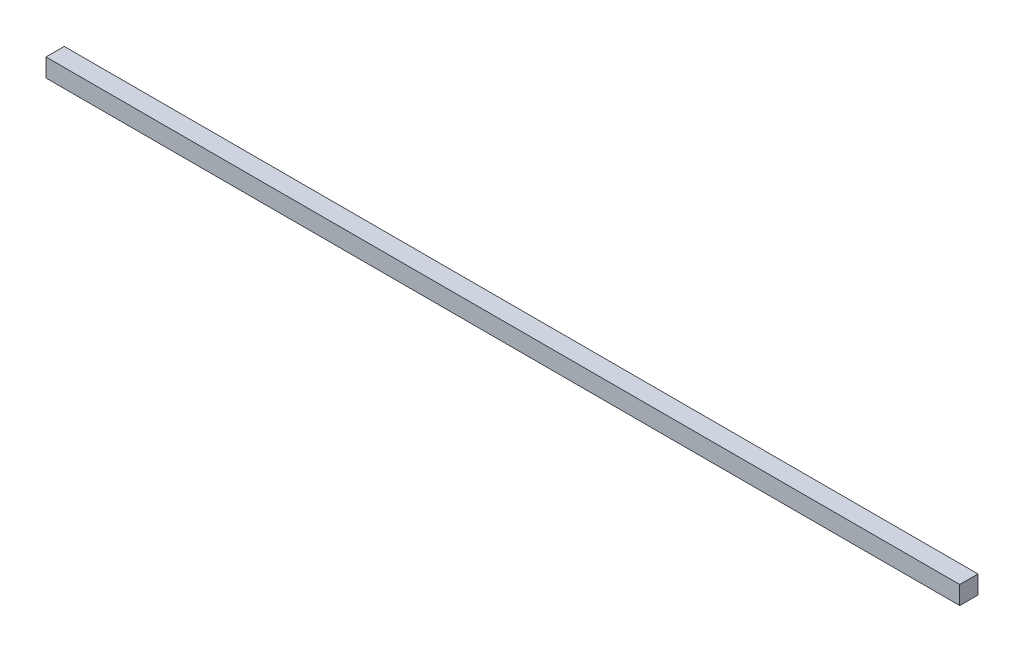
ISO-10303-21;
HEADER;
FILE_DESCRIPTION(('STEP AP214'),'2;1');
FILE_NAME('part.step','',(''),(''),'','','');
FILE_SCHEMA(('AUTOMOTIVE_DESIGN { 1 0 10303 214 1 1 1 1 }'));
ENDSEC;
DATA;
#1=APPLICATION_CONTEXT('core data for automotive mechanical design processes');
#2=APPLICATION_PROTOCOL_DEFINITION('international standard','automotive_design',2000,#1);
#3=PRODUCT_CONTEXT('',#1,'mechanical');
#4=PRODUCT('Part','Part','',(#3));
#5=PRODUCT_RELATED_PRODUCT_CATEGORY('part','',(#4));
#6=PRODUCT_DEFINITION_FORMATION('','',#4);
#7=PRODUCT_DEFINITION_CONTEXT('part definition',#1,'design');
#8=PRODUCT_DEFINITION('design','',#6,#7);
#9=PRODUCT_DEFINITION_SHAPE('','',#8);
#10=(LENGTH_UNIT() NAMED_UNIT(*) SI_UNIT(.MILLI.,.METRE.));
#11=(NAMED_UNIT(*) PLANE_ANGLE_UNIT() SI_UNIT($,.RADIAN.));
#12=(NAMED_UNIT(*) SI_UNIT($,.STERADIAN.) SOLID_ANGLE_UNIT());
#13=UNCERTAINTY_MEASURE_WITH_UNIT(LENGTH_MEASURE(1.E-05),#10,'distance_accuracy_value','');
#14=(GEOMETRIC_REPRESENTATION_CONTEXT(3) GLOBAL_UNCERTAINTY_ASSIGNED_CONTEXT((#13)) GLOBAL_UNIT_ASSIGNED_CONTEXT((#10,
#11,#12)) REPRESENTATION_CONTEXT('',''));
#15=CARTESIAN_POINT('',(0.,0.,0.));
#16=DIRECTION('',(0.,0.,1.));
#17=DIRECTION('',(1.,0.,0.));
#18=AXIS2_PLACEMENT_3D('',#15,#16,#17);
#19=CARTESIAN_POINT('',(100.,-1.,-1.));
#20=DIRECTION('',(0.,0.,1.));
#21=DIRECTION('',(1.,0.,0.));
#22=AXIS2_PLACEMENT_3D('',#19,#20,#21);
#23=PLANE('',#22);
#24=DIRECTION('',(0.,1.,0.));
#25=VECTOR('',#24,1.);
#26=CARTESIAN_POINT('',(0.,-1.,-1.));
#27=LINE('',#26,#25);
#28=CARTESIAN_POINT('',(0.,-1.,-1.));
#29=VERTEX_POINT('',#28);
#30=CARTESIAN_POINT('',(0.,1.,-1.));
#31=VERTEX_POINT('',#30);
#32=EDGE_CURVE('E98',#29,#31,#27,.T.);
#33=ORIENTED_EDGE('',*,*,#32,.T.);
#34=DIRECTION('',(-1.,0.,0.));
#35=VECTOR('',#34,1.);
#36=CARTESIAN_POINT('',(100.,1.,-1.));
#37=LINE('',#36,#35);
#38=CARTESIAN_POINT('',(100.,1.,-1.));
#39=VERTEX_POINT('',#38);
#40=EDGE_CURVE('E11',#39,#31,#37,.T.);
#41=ORIENTED_EDGE('',*,*,#40,.F.);
#42=DIRECTION('',(0.,1.,0.));
#43=VECTOR('',#42,1.);
#44=CARTESIAN_POINT('',(100.,-1.,-1.));
#45=LINE('',#44,#43);
#46=CARTESIAN_POINT('',(100.,-1.,-1.));
#47=VERTEX_POINT('',#46);
#48=EDGE_CURVE('E86',#47,#39,#45,.T.);
#49=ORIENTED_EDGE('',*,*,#48,.F.);
#50=DIRECTION('',(-1.,0.,0.));
#51=VECTOR('',#50,1.);
#52=CARTESIAN_POINT('',(100.,-1.,-1.));
#53=LINE('',#52,#51);
#54=EDGE_CURVE('E94',#47,#29,#53,.T.);
#55=ORIENTED_EDGE('',*,*,#54,.T.);
#56=EDGE_LOOP('',(#33,#41,#49,#55));
#57=FACE_BOUND('',#56,.T.);
#58=ADVANCED_FACE('F35',(#57),#23,.F.);
#59=CARTESIAN_POINT('',(100.,1.,1.));
#60=DIRECTION('',(0.,-1.,0.));
#61=DIRECTION('',(0.,0.,-1.));
#62=AXIS2_PLACEMENT_3D('',#59,#60,#61);
#63=PLANE('',#62);
#64=DIRECTION('',(0.,0.,1.));
#65=VECTOR('',#64,1.);
#66=CARTESIAN_POINT('',(0.,1.,1.));
#67=LINE('',#66,#65);
#68=CARTESIAN_POINT('',(0.,1.,1.));
#69=VERTEX_POINT('',#68);
#70=EDGE_CURVE('E90',#31,#69,#67,.T.);
#71=ORIENTED_EDGE('',*,*,#70,.T.);
#72=DIRECTION('',(-1.,0.,0.));
#73=VECTOR('',#72,1.);
#74=CARTESIAN_POINT('',(100.,1.,1.));
#75=LINE('',#74,#73);
#76=CARTESIAN_POINT('',(100.,1.,1.));
#77=VERTEX_POINT('',#76);
#78=EDGE_CURVE('E43',#77,#69,#75,.T.);
#79=ORIENTED_EDGE('',*,*,#78,.F.);
#80=DIRECTION('',(0.,0.,1.));
#81=VECTOR('',#80,1.);
#82=CARTESIAN_POINT('',(100.,1.,1.));
#83=LINE('',#82,#81);
#84=EDGE_CURVE('E81',#39,#77,#83,.T.);
#85=ORIENTED_EDGE('',*,*,#84,.F.);
#86=ORIENTED_EDGE('',*,*,#40,.T.);
#87=EDGE_LOOP('',(#71,#79,#85,#86));
#88=FACE_BOUND('',#87,.T.);
#89=ADVANCED_FACE('F89',(#88),#63,.F.);
#90=CARTESIAN_POINT('',(100.,-1.,1.));
#91=DIRECTION('',(0.,0.,-1.));
#92=DIRECTION('',(-1.,0.,0.));
#93=AXIS2_PLACEMENT_3D('',#90,#91,#92);
#94=PLANE('',#93);
#95=DIRECTION('',(0.,-1.,0.));
#96=VECTOR('',#95,1.);
#97=CARTESIAN_POINT('',(0.,-1.,1.));
#98=LINE('',#97,#96);
#99=CARTESIAN_POINT('',(0.,-1.,1.));
#100=VERTEX_POINT('',#99);
#101=EDGE_CURVE('E68',#69,#100,#98,.T.);
#102=ORIENTED_EDGE('',*,*,#101,.T.);
#103=DIRECTION('',(-1.,0.,0.));
#104=VECTOR('',#103,1.);
#105=CARTESIAN_POINT('',(100.,-1.,1.));
#106=LINE('',#105,#104);
#107=CARTESIAN_POINT('',(100.,-1.,1.));
#108=VERTEX_POINT('',#107);
#109=EDGE_CURVE('E91',#108,#100,#106,.T.);
#110=ORIENTED_EDGE('',*,*,#109,.F.);
#111=DIRECTION('',(0.,-1.,0.));
#112=VECTOR('',#111,1.);
#113=CARTESIAN_POINT('',(100.,-1.,1.));
#114=LINE('',#113,#112);
#115=EDGE_CURVE('E84',#77,#108,#114,.T.);
#116=ORIENTED_EDGE('',*,*,#115,.F.);
#117=ORIENTED_EDGE('',*,*,#78,.T.);
#118=EDGE_LOOP('',(#102,#110,#116,#117));
#119=FACE_BOUND('',#118,.T.);
#120=ADVANCED_FACE('F92',(#119),#94,.F.);
#121=CARTESIAN_POINT('',(100.,-1.,1.));
#122=DIRECTION('',(0.,1.,0.));
#123=DIRECTION('',(0.,0.,1.));
#124=AXIS2_PLACEMENT_3D('',#121,#122,#123);
#125=PLANE('',#124);
#126=DIRECTION('',(0.,0.,-1.));
#127=VECTOR('',#126,1.);
#128=CARTESIAN_POINT('',(0.,-1.,1.));
#129=LINE('',#128,#127);
#130=EDGE_CURVE('E74',#100,#29,#129,.T.);
#131=ORIENTED_EDGE('',*,*,#130,.T.);
#132=ORIENTED_EDGE('',*,*,#54,.F.);
#133=DIRECTION('',(0.,0.,-1.));
#134=VECTOR('',#133,1.);
#135=CARTESIAN_POINT('',(100.,-1.,1.));
#136=LINE('',#135,#134);
#137=EDGE_CURVE('E51',#108,#47,#136,.T.);
#138=ORIENTED_EDGE('',*,*,#137,.F.);
#139=ORIENTED_EDGE('',*,*,#109,.T.);
#140=EDGE_LOOP('',(#131,#132,#138,#139));
#141=FACE_BOUND('',#140,.T.);
#142=ADVANCED_FACE('F105',(#141),#125,.F.);
#143=CARTESIAN_POINT('',(100.,0.,0.));
#144=DIRECTION('',(-1.,0.,0.));
#145=DIRECTION('',(0.,0.,1.));
#146=AXIS2_PLACEMENT_3D('',#143,#144,#145);
#147=PLANE('',#146);
#148=ORIENTED_EDGE('',*,*,#48,.T.);
#149=ORIENTED_EDGE('',*,*,#84,.T.);
#150=ORIENTED_EDGE('',*,*,#115,.T.);
#151=ORIENTED_EDGE('',*,*,#137,.T.);
#152=EDGE_LOOP('',(#148,#149,#150,#151));
#153=FACE_BOUND('',#152,.T.);
#154=ADVANCED_FACE('F82',(#153),#147,.F.);
#155=CARTESIAN_POINT('',(0.,0.,0.));
#156=DIRECTION('',(-1.,0.,0.));
#157=DIRECTION('',(0.,0.,1.));
#158=AXIS2_PLACEMENT_3D('',#155,#156,#157);
#159=PLANE('',#158);
#160=ORIENTED_EDGE('',*,*,#32,.F.);
#161=ORIENTED_EDGE('',*,*,#130,.F.);
#162=ORIENTED_EDGE('',*,*,#101,.F.);
#163=ORIENTED_EDGE('',*,*,#70,.F.);
#164=EDGE_LOOP('',(#160,#161,#162,#163));
#165=FACE_BOUND('',#164,.T.);
#166=ADVANCED_FACE('F108',(#165),#159,.T.);
#167=CLOSED_SHELL('',(#58,#89,#120,#142,#154,#166));
#168=MANIFOLD_SOLID_BREP('B2',#167);
#169=ADVANCED_BREP_SHAPE_REPRESENTATION('',(#18,#168),#14);
#170=SHAPE_DEFINITION_REPRESENTATION(#9,#169);
ENDSEC;
END-ISO-10303-21;
